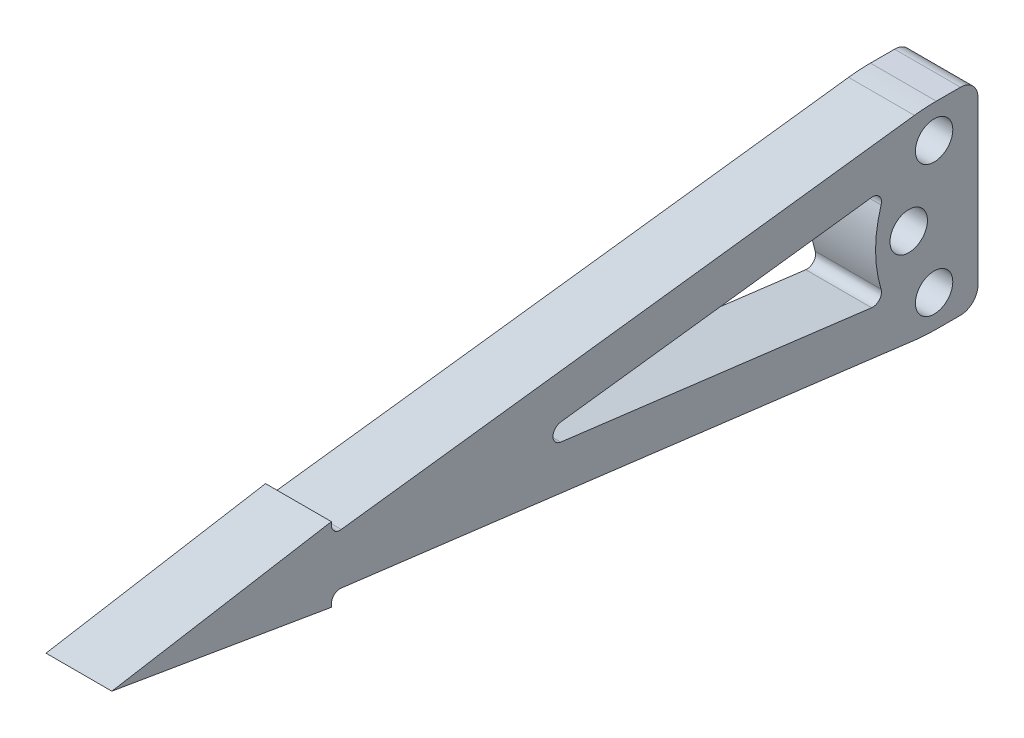
ISO-10303-21;
HEADER;
FILE_DESCRIPTION(('STEP AP214'),'2;1');
FILE_NAME('part.step','',(''),(''),'','','');
FILE_SCHEMA(('AUTOMOTIVE_DESIGN { 1 0 10303 214 1 1 1 1 }'));
ENDSEC;
DATA;
#1=APPLICATION_CONTEXT('core data for automotive mechanical design processes');
#2=APPLICATION_PROTOCOL_DEFINITION('international standard','automotive_design',2000,#1);
#3=PRODUCT_CONTEXT('',#1,'mechanical');
#4=PRODUCT('Part','Part','',(#3));
#5=PRODUCT_RELATED_PRODUCT_CATEGORY('part','',(#4));
#6=PRODUCT_DEFINITION_FORMATION('','',#4);
#7=PRODUCT_DEFINITION_CONTEXT('part definition',#1,'design');
#8=PRODUCT_DEFINITION('design','',#6,#7);
#9=PRODUCT_DEFINITION_SHAPE('','',#8);
#10=(LENGTH_UNIT() NAMED_UNIT(*) SI_UNIT(.MILLI.,.METRE.));
#11=(NAMED_UNIT(*) PLANE_ANGLE_UNIT() SI_UNIT($,.RADIAN.));
#12=(NAMED_UNIT(*) SI_UNIT($,.STERADIAN.) SOLID_ANGLE_UNIT());
#13=UNCERTAINTY_MEASURE_WITH_UNIT(LENGTH_MEASURE(1.E-05),#10,'distance_accuracy_value','');
#14=(GEOMETRIC_REPRESENTATION_CONTEXT(3) GLOBAL_UNCERTAINTY_ASSIGNED_CONTEXT((#13)) GLOBAL_UNIT_ASSIGNED_CONTEXT((#10,
#11,#12)) REPRESENTATION_CONTEXT('',''));
#15=CARTESIAN_POINT('',(0.,0.,0.));
#16=DIRECTION('',(0.,0.,1.));
#17=DIRECTION('',(1.,0.,0.));
#18=AXIS2_PLACEMENT_3D('',#15,#16,#17);
#19=CARTESIAN_POINT('',(-47.625,21.9075,120.65));
#20=DIRECTION('',(0.,0.992196421373541,-0.124684647866279));
#21=DIRECTION('',(0.,0.124684647866279,0.992196421373541));
#22=AXIS2_PLACEMENT_3D('',#19,#20,#21);
#23=PLANE('',#22);
#24=DIRECTION('',(0.,0.124684647866279,0.992196421373541));
#25=VECTOR('',#24,1.);
#26=CARTESIAN_POINT('',(-47.625,21.9075,120.65));
#27=LINE('',#26,#25);
#28=CARTESIAN_POINT('',(-47.625,11.310710897112,36.3244923624304));
#29=VERTEX_POINT('',#28);
#30=CARTESIAN_POINT('',(-47.625,21.7280060500633,119.22165049721));
#31=VERTEX_POINT('',#30);
#32=EDGE_CURVE('E192',#29,#31,#27,.T.);
#33=ORIENTED_EDGE('',*,*,#32,.F.);
#34=DIRECTION('',(1.,0.,0.));
#35=VECTOR('',#34,1.);
#36=CARTESIAN_POINT('',(-47.625,11.310710897112,36.3244923624304));
#37=LINE('',#36,#35);
#38=CARTESIAN_POINT('',(-38.1,11.310710897112,36.3244923624304));
#39=VERTEX_POINT('',#38);
#40=EDGE_CURVE('E331',#29,#39,#37,.T.);
#41=ORIENTED_EDGE('',*,*,#40,.T.);
#42=DIRECTION('',(0.,0.124684647866279,0.992196421373541));
#43=VECTOR('',#42,1.);
#44=CARTESIAN_POINT('',(-38.1,21.9075,120.65));
#45=LINE('',#44,#43);
#46=CARTESIAN_POINT('',(-38.1,21.7280060500633,119.22165049721));
#47=VERTEX_POINT('',#46);
#48=EDGE_CURVE('E225',#39,#47,#45,.T.);
#49=ORIENTED_EDGE('',*,*,#48,.T.);
#50=DIRECTION('',(1.,0.,0.));
#51=VECTOR('',#50,1.);
#52=CARTESIAN_POINT('',(-47.625,21.7280060500633,119.22165049721));
#53=LINE('',#52,#51);
#54=EDGE_CURVE('E315',#47,#31,#53,.F.);
#55=ORIENTED_EDGE('',*,*,#54,.T.);
#56=EDGE_LOOP('',(#33,#41,#49,#55));
#57=FACE_BOUND('',#56,.T.);
#58=ADVANCED_FACE('F39',(#57),#23,.F.);
#59=CARTESIAN_POINT('',(-47.625,20.0332704824739,120.65));
#60=DIRECTION('',(0.,0.,1.));
#61=DIRECTION('',(1.,0.,0.));
#62=AXIS2_PLACEMENT_3D('',#59,#60,#61);
#63=PLANE('',#62);
#64=DIRECTION('',(0.,-1.,0.));
#65=VECTOR('',#64,1.);
#66=CARTESIAN_POINT('',(-47.625,20.0332704824739,120.65));
#67=LINE('',#66,#65);
#68=CARTESIAN_POINT('',(-47.625,20.4679165949189,120.65));
#69=VERTEX_POINT('',#68);
#70=CARTESIAN_POINT('',(-47.625,20.0332704824739,120.65));
#71=VERTEX_POINT('',#70);
#72=EDGE_CURVE('E180',#69,#71,#67,.T.);
#73=ORIENTED_EDGE('',*,*,#72,.F.);
#74=DIRECTION('',(1.,0.,0.));
#75=VECTOR('',#74,1.);
#76=CARTESIAN_POINT('',(-38.1,20.4679165949189,120.65));
#77=LINE('',#76,#75);
#78=CARTESIAN_POINT('',(-38.1,20.4679165949189,120.65));
#79=VERTEX_POINT('',#78);
#80=EDGE_CURVE('E313',#69,#79,#77,.T.);
#81=ORIENTED_EDGE('',*,*,#80,.T.);
#82=DIRECTION('',(0.,-1.,0.));
#83=VECTOR('',#82,1.);
#84=CARTESIAN_POINT('',(-38.1,20.0332704824739,120.65));
#85=LINE('',#84,#83);
#86=CARTESIAN_POINT('',(-38.1,20.0332704824739,120.65));
#87=VERTEX_POINT('',#86);
#88=EDGE_CURVE('E198',#79,#87,#85,.T.);
#89=ORIENTED_EDGE('',*,*,#88,.T.);
#90=DIRECTION('',(1.,0.,0.));
#91=VECTOR('',#90,1.);
#92=CARTESIAN_POINT('',(-47.625,20.0332704824739,120.65));
#93=LINE('',#92,#91);
#94=EDGE_CURVE('E195',#71,#87,#93,.T.);
#95=ORIENTED_EDGE('',*,*,#94,.F.);
#96=EDGE_LOOP('',(#73,#81,#89,#95));
#97=FACE_BOUND('',#96,.T.);
#98=ADVANCED_FACE('F196',(#97),#63,.F.);
#99=CARTESIAN_POINT('',(-47.625,25.4,152.4));
#100=DIRECTION('',(0.,0.986013297183269,-0.166666666666666));
#101=DIRECTION('',(0.,0.166666666666666,0.986013297183269));
#102=AXIS2_PLACEMENT_3D('',#99,#100,#101);
#103=PLANE('',#102);
#104=DIRECTION('',(0.,0.166666666666666,0.986013297183269));
#105=VECTOR('',#104,1.);
#106=CARTESIAN_POINT('',(-38.1,25.4,152.4));
#107=LINE('',#106,#105);
#108=CARTESIAN_POINT('',(-38.1,25.4,152.4));
#109=VERTEX_POINT('',#108);
#110=EDGE_CURVE('E229',#87,#109,#107,.T.);
#111=ORIENTED_EDGE('',*,*,#110,.T.);
#112=DIRECTION('',(1.,0.,0.));
#113=VECTOR('',#112,1.);
#114=CARTESIAN_POINT('',(-47.625,25.4,152.4));
#115=LINE('',#114,#113);
#116=CARTESIAN_POINT('',(-47.625,25.4,152.4));
#117=VERTEX_POINT('',#116);
#118=EDGE_CURVE('E202',#117,#109,#115,.T.);
#119=ORIENTED_EDGE('',*,*,#118,.F.);
#120=DIRECTION('',(0.,0.166666666666666,0.986013297183269));
#121=VECTOR('',#120,1.);
#122=CARTESIAN_POINT('',(-47.625,25.4,152.4));
#123=LINE('',#122,#121);
#124=EDGE_CURVE('E185',#71,#117,#123,.T.);
#125=ORIENTED_EDGE('',*,*,#124,.F.);
#126=ORIENTED_EDGE('',*,*,#94,.T.);
#127=EDGE_LOOP('',(#111,#119,#125,#126));
#128=FACE_BOUND('',#127,.T.);
#129=ADVANCED_FACE('F204',(#128),#103,.F.);
#130=CARTESIAN_POINT('',(-47.625,30.7667295175261,120.65));
#131=DIRECTION('',(0.,-0.986013297183269,-0.166666666666667));
#132=DIRECTION('',(0.,0.166666666666667,-0.986013297183269));
#133=AXIS2_PLACEMENT_3D('',#130,#131,#132);
#134=PLANE('',#133);
#135=DIRECTION('',(0.,0.166666666666667,-0.986013297183269));
#136=VECTOR('',#135,1.);
#137=CARTESIAN_POINT('',(-38.1,30.7667295175261,120.65));
#138=LINE('',#137,#136);
#139=CARTESIAN_POINT('',(-38.1,30.7667295175261,120.65));
#140=VERTEX_POINT('',#139);
#141=EDGE_CURVE('E231',#109,#140,#138,.T.);
#142=ORIENTED_EDGE('',*,*,#141,.T.);
#143=DIRECTION('',(1.,0.,0.));
#144=VECTOR('',#143,1.);
#145=CARTESIAN_POINT('',(-47.625,30.7667295175261,120.65));
#146=LINE('',#145,#144);
#147=CARTESIAN_POINT('',(-47.625,30.7667295175261,120.65));
#148=VERTEX_POINT('',#147);
#149=EDGE_CURVE('E224',#148,#140,#146,.T.);
#150=ORIENTED_EDGE('',*,*,#149,.F.);
#151=DIRECTION('',(0.,0.166666666666667,-0.986013297183269));
#152=VECTOR('',#151,1.);
#153=CARTESIAN_POINT('',(-47.625,30.7667295175261,120.65));
#154=LINE('',#153,#152);
#155=EDGE_CURVE('E207',#117,#148,#154,.T.);
#156=ORIENTED_EDGE('',*,*,#155,.F.);
#157=ORIENTED_EDGE('',*,*,#118,.T.);
#158=EDGE_LOOP('',(#142,#150,#156,#157));
#159=FACE_BOUND('',#158,.T.);
#160=ADVANCED_FACE('F505',(#159),#134,.F.);
#161=CARTESIAN_POINT('',(-47.625,28.8925,120.65));
#162=DIRECTION('',(0.,0.,1.));
#163=DIRECTION('',(1.,0.,0.));
#164=AXIS2_PLACEMENT_3D('',#161,#162,#163);
#165=PLANE('',#164);
#166=DIRECTION('',(0.,-1.,0.));
#167=VECTOR('',#166,1.);
#168=CARTESIAN_POINT('',(-38.1,28.8925,120.65));
#169=LINE('',#168,#167);
#170=CARTESIAN_POINT('',(-38.1,30.3320834050811,120.65));
#171=VERTEX_POINT('',#170);
#172=EDGE_CURVE('E233',#140,#171,#169,.T.);
#173=ORIENTED_EDGE('',*,*,#172,.T.);
#174=DIRECTION('',(1.,0.,0.));
#175=VECTOR('',#174,1.);
#176=CARTESIAN_POINT('',(-47.625,30.3320834050811,120.65));
#177=LINE('',#176,#175);
#178=CARTESIAN_POINT('',(-47.625,30.3320834050811,120.65));
#179=VERTEX_POINT('',#178);
#180=EDGE_CURVE('E321',#171,#179,#177,.F.);
#181=ORIENTED_EDGE('',*,*,#180,.T.);
#182=DIRECTION('',(0.,-1.,0.));
#183=VECTOR('',#182,1.);
#184=CARTESIAN_POINT('',(-47.625,28.8925,120.65));
#185=LINE('',#184,#183);
#186=EDGE_CURVE('E209',#148,#179,#185,.T.);
#187=ORIENTED_EDGE('',*,*,#186,.F.);
#188=ORIENTED_EDGE('',*,*,#149,.T.);
#189=EDGE_LOOP('',(#173,#181,#187,#188));
#190=FACE_BOUND('',#189,.T.);
#191=ADVANCED_FACE('F499',(#190),#165,.F.);
#192=CARTESIAN_POINT('',(-47.625,39.6875,34.7472));
#193=DIRECTION('',(0.,-0.992196421373541,-0.124684647866279));
#194=DIRECTION('',(0.,0.124684647866279,-0.992196421373541));
#195=AXIS2_PLACEMENT_3D('',#192,#193,#194);
#196=PLANE('',#195);
#197=DIRECTION('',(0.,0.124684647866279,-0.992196421373541));
#198=VECTOR('',#197,1.);
#199=CARTESIAN_POINT('',(-38.1,39.6875,34.7472));
#200=LINE('',#199,#198);
#201=CARTESIAN_POINT('',(-38.1,29.0719939499367,119.22165049721));
#202=VERTEX_POINT('',#201);
#203=CARTESIAN_POINT('',(-38.1,39.489289102888,36.3244923624304));
#204=VERTEX_POINT('',#203);
#205=EDGE_CURVE('E236',#202,#204,#200,.T.);
#206=ORIENTED_EDGE('',*,*,#205,.T.);
#207=DIRECTION('',(1.,0.,0.));
#208=VECTOR('',#207,1.);
#209=CARTESIAN_POINT('',(-47.625,39.489289102888,36.3244923624304));
#210=LINE('',#209,#208);
#211=CARTESIAN_POINT('',(-47.625,39.489289102888,36.3244923624304));
#212=VERTEX_POINT('',#211);
#213=EDGE_CURVE('E11',#204,#212,#210,.F.);
#214=ORIENTED_EDGE('',*,*,#213,.T.);
#215=DIRECTION('',(0.,0.124684647866279,-0.992196421373541));
#216=VECTOR('',#215,1.);
#217=CARTESIAN_POINT('',(-47.625,39.6875,34.7472));
#218=LINE('',#217,#216);
#219=CARTESIAN_POINT('',(-47.625,29.0719939499367,119.22165049721));
#220=VERTEX_POINT('',#219);
#221=EDGE_CURVE('E215',#220,#212,#218,.T.);
#222=ORIENTED_EDGE('',*,*,#221,.F.);
#223=DIRECTION('',(1.,0.,0.));
#224=VECTOR('',#223,1.);
#225=CARTESIAN_POINT('',(-38.1,29.0719939499367,119.22165049721));
#226=LINE('',#225,#224);
#227=EDGE_CURVE('E318',#220,#202,#226,.T.);
#228=ORIENTED_EDGE('',*,*,#227,.T.);
#229=EDGE_LOOP('',(#206,#214,#222,#228));
#230=FACE_BOUND('',#229,.T.);
#231=ADVANCED_FACE('F504',(#230),#196,.F.);
#232=CARTESIAN_POINT('',(-47.625,39.6875,27.1272));
#233=DIRECTION('',(0.,-1.,0.));
#234=DIRECTION('',(0.,0.,-1.));
#235=AXIS2_PLACEMENT_3D('',#232,#233,#234);
#236=PLANE('',#235);
#237=DIRECTION('',(0.,0.,-1.));
#238=VECTOR('',#237,1.);
#239=CARTESIAN_POINT('',(-47.625,39.6875,27.1272));
#240=LINE('',#239,#238);
#241=CARTESIAN_POINT('',(-47.625,39.6875,33.1575023066269));
#242=VERTEX_POINT('',#241);
#243=CARTESIAN_POINT('',(-47.625,39.6875,29.6672));
#244=VERTEX_POINT('',#243);
#245=EDGE_CURVE('E217',#242,#244,#240,.T.);
#246=ORIENTED_EDGE('',*,*,#245,.F.);
#247=DIRECTION('',(1.,0.,0.));
#248=VECTOR('',#247,1.);
#249=CARTESIAN_POINT('',(-47.625,39.6875,33.1575023066269));
#250=LINE('',#249,#248);
#251=CARTESIAN_POINT('',(-38.1,39.6875,33.1575023066269));
#252=VERTEX_POINT('',#251);
#253=EDGE_CURVE('E47',#242,#252,#250,.T.);
#254=ORIENTED_EDGE('',*,*,#253,.T.);
#255=DIRECTION('',(0.,0.,-1.));
#256=VECTOR('',#255,1.);
#257=CARTESIAN_POINT('',(-38.1,39.6875,27.1272));
#258=LINE('',#257,#256);
#259=CARTESIAN_POINT('',(-38.1,39.6875,29.6672));
#260=VERTEX_POINT('',#259);
#261=EDGE_CURVE('E238',#252,#260,#258,.T.);
#262=ORIENTED_EDGE('',*,*,#261,.T.);
#263=DIRECTION('',(1.,0.,0.));
#264=VECTOR('',#263,1.);
#265=CARTESIAN_POINT('',(-47.625,39.6875,29.6672));
#266=LINE('',#265,#264);
#267=EDGE_CURVE('E283',#260,#244,#266,.F.);
#268=ORIENTED_EDGE('',*,*,#267,.T.);
#269=EDGE_LOOP('',(#246,#254,#262,#268));
#270=FACE_BOUND('',#269,.T.);
#271=ADVANCED_FACE('F346',(#270),#236,.F.);
#272=CARTESIAN_POINT('',(-47.625,11.1125,27.1272));
#273=DIRECTION('',(0.,0.,1.));
#274=DIRECTION('',(1.,0.,0.));
#275=AXIS2_PLACEMENT_3D('',#272,#273,#274);
#276=PLANE('',#275);
#277=DIRECTION('',(0.,-1.,0.));
#278=VECTOR('',#277,1.);
#279=CARTESIAN_POINT('',(-38.1,11.1125,27.1272));
#280=LINE('',#279,#278);
#281=CARTESIAN_POINT('',(-38.1,37.1475,27.1272));
#282=VERTEX_POINT('',#281);
#283=CARTESIAN_POINT('',(-38.1,13.6525,27.1272));
#284=VERTEX_POINT('',#283);
#285=EDGE_CURVE('E240',#282,#284,#280,.T.);
#286=ORIENTED_EDGE('',*,*,#285,.T.);
#287=DIRECTION('',(1.,0.,0.));
#288=VECTOR('',#287,1.);
#289=CARTESIAN_POINT('',(-47.625,13.6525,27.1272));
#290=LINE('',#289,#288);
#291=CARTESIAN_POINT('',(-47.625,13.6525,27.1272));
#292=VERTEX_POINT('',#291);
#293=EDGE_CURVE('E277',#284,#292,#290,.F.);
#294=ORIENTED_EDGE('',*,*,#293,.T.);
#295=DIRECTION('',(0.,-1.,0.));
#296=VECTOR('',#295,1.);
#297=CARTESIAN_POINT('',(-47.625,11.1125,27.1272));
#298=LINE('',#297,#296);
#299=CARTESIAN_POINT('',(-47.625,37.1475,27.1272));
#300=VERTEX_POINT('',#299);
#301=EDGE_CURVE('E219',#300,#292,#298,.T.);
#302=ORIENTED_EDGE('',*,*,#301,.F.);
#303=DIRECTION('',(1.,0.,0.));
#304=VECTOR('',#303,1.);
#305=CARTESIAN_POINT('',(-47.625,37.1475,27.1272));
#306=LINE('',#305,#304);
#307=EDGE_CURVE('E274',#300,#282,#306,.T.);
#308=ORIENTED_EDGE('',*,*,#307,.T.);
#309=EDGE_LOOP('',(#286,#294,#302,#308));
#310=FACE_BOUND('',#309,.T.);
#311=ADVANCED_FACE('F361',(#310),#276,.F.);
#312=CARTESIAN_POINT('',(-47.625,11.1125,34.7472));
#313=DIRECTION('',(0.,1.,0.));
#314=DIRECTION('',(0.,0.,1.));
#315=AXIS2_PLACEMENT_3D('',#312,#313,#314);
#316=PLANE('',#315);
#317=DIRECTION('',(0.,0.,1.));
#318=VECTOR('',#317,1.);
#319=CARTESIAN_POINT('',(-38.1,11.1125,34.7472));
#320=LINE('',#319,#318);
#321=CARTESIAN_POINT('',(-38.1,11.1125,29.6672));
#322=VERTEX_POINT('',#321);
#323=CARTESIAN_POINT('',(-38.1,11.1125,33.1575023066269));
#324=VERTEX_POINT('',#323);
#325=EDGE_CURVE('E243',#322,#324,#320,.T.);
#326=ORIENTED_EDGE('',*,*,#325,.T.);
#327=DIRECTION('',(1.,0.,0.));
#328=VECTOR('',#327,1.);
#329=CARTESIAN_POINT('',(-47.625,11.1125,33.1575023066269));
#330=LINE('',#329,#328);
#331=CARTESIAN_POINT('',(-47.625,11.1125,33.1575023066269));
#332=VERTEX_POINT('',#331);
#333=EDGE_CURVE('E338',#324,#332,#330,.F.);
#334=ORIENTED_EDGE('',*,*,#333,.T.);
#335=DIRECTION('',(0.,0.,1.));
#336=VECTOR('',#335,1.);
#337=CARTESIAN_POINT('',(-47.625,11.1125,34.7472));
#338=LINE('',#337,#336);
#339=CARTESIAN_POINT('',(-47.625,11.1125,29.6672));
#340=VERTEX_POINT('',#339);
#341=EDGE_CURVE('E222',#340,#332,#338,.T.);
#342=ORIENTED_EDGE('',*,*,#341,.F.);
#343=DIRECTION('',(1.,0.,0.));
#344=VECTOR('',#343,1.);
#345=CARTESIAN_POINT('',(-47.625,11.1125,29.6672));
#346=LINE('',#345,#344);
#347=EDGE_CURVE('E257',#340,#322,#346,.T.);
#348=ORIENTED_EDGE('',*,*,#347,.T.);
#349=EDGE_LOOP('',(#326,#334,#342,#348));
#350=FACE_BOUND('',#349,.T.);
#351=ADVANCED_FACE('F369',(#350),#316,.F.);
#352=CARTESIAN_POINT('',(-47.625,0.,0.));
#353=DIRECTION('',(1.,0.,0.));
#354=DIRECTION('',(0.,0.,-1.));
#355=AXIS2_PLACEMENT_3D('',#352,#353,#354);
#356=PLANE('',#355);
#357=CARTESIAN_POINT('',(-47.625,34.925,33.4772));
#358=DIRECTION('',(-1.,0.,0.));
#359=DIRECTION('',(0.,0.,1.));
#360=AXIS2_PLACEMENT_3D('',#357,#358,#359);
#361=CIRCLE('',#360,2.7051);
#362=CARTESIAN_POINT('',(-47.625,34.925,36.1823));
#363=VERTEX_POINT('',#362);
#364=EDGE_CURVE('E262',#363,#363,#361,.T.);
#365=ORIENTED_EDGE('',*,*,#364,.F.);
#366=EDGE_LOOP('',(#365));
#367=FACE_BOUND('',#366,.T.);
#368=CARTESIAN_POINT('',(-47.625,25.4,37.1437958465632));
#369=DIRECTION('',(-1.,0.,0.));
#370=DIRECTION('',(0.,0.,1.));
#371=AXIS2_PLACEMENT_3D('',#368,#369,#370);
#372=CIRCLE('',#371,2.7051);
#373=CARTESIAN_POINT('',(-47.625,25.4,39.8488958465632));
#374=VERTEX_POINT('',#373);
#375=EDGE_CURVE('E391',#374,#374,#372,.T.);
#376=ORIENTED_EDGE('',*,*,#375,.F.);
#377=EDGE_LOOP('',(#376));
#378=FACE_BOUND('',#377,.T.);
#379=CARTESIAN_POINT('',(-47.625,15.875,33.4772));
#380=DIRECTION('',(-1.,0.,0.));
#381=DIRECTION('',(0.,0.,1.));
#382=AXIS2_PLACEMENT_3D('',#379,#380,#381);
#383=CIRCLE('',#382,2.7051);
#384=CARTESIAN_POINT('',(-47.625,15.875,36.1823));
#385=VERTEX_POINT('',#384);
#386=EDGE_CURVE('E382',#385,#385,#383,.T.);
#387=ORIENTED_EDGE('',*,*,#386,.F.);
#388=EDGE_LOOP('',(#387));
#389=FACE_BOUND('',#388,.T.);
#390=DIRECTION('',(0.,0.124684647866279,0.992196421373541));
#391=VECTOR('',#390,1.);
#392=CARTESIAN_POINT('',(-47.625,25.4,97.5135991060685));
#393=LINE('',#392,#391);
#394=CARTESIAN_POINT('',(-47.625,18.4886100444257,42.51519715371));
#395=VERTEX_POINT('',#394);
#396=CARTESIAN_POINT('',(-47.625,24.1399105448556,87.4862519594841));
#397=VERTEX_POINT('',#396);
#398=EDGE_CURVE('E383',#395,#397,#393,.T.);
#399=ORIENTED_EDGE('',*,*,#398,.F.);
#400=CARTESIAN_POINT('',(-47.625,19.7486994995701,42.3568476509198));
#401=DIRECTION('',(1.,0.,0.));
#402=DIRECTION('',(0.,0.,-1.));
#403=AXIS2_PLACEMENT_3D('',#400,#401,#402);
#404=CIRCLE('',#403,1.27);
#405=CARTESIAN_POINT('',(-47.625,20.1254528662654,41.1440175306294));
#406=VERTEX_POINT('',#405);
#407=EDGE_CURVE('E305',#395,#406,#404,.T.);
#408=ORIENTED_EDGE('',*,*,#407,.T.);
#409=CARTESIAN_POINT('',(-47.625,25.4,24.1643958465632));
#410=DIRECTION('',(1.,0.,0.));
#411=DIRECTION('',(0.,0.,1.));
#412=AXIS2_PLACEMENT_3D('',#409,#410,#411);
#413=CIRCLE('',#412,17.78);
#414=CARTESIAN_POINT('',(-47.625,30.6745471337346,41.1440175306294));
#415=VERTEX_POINT('',#414);
#416=EDGE_CURVE('E379',#415,#406,#413,.T.);
#417=ORIENTED_EDGE('',*,*,#416,.F.);
#418=CARTESIAN_POINT('',(-47.625,31.0513005004299,42.3568476509198));
#419=DIRECTION('',(1.,0.,0.));
#420=DIRECTION('',(0.,0.,-1.));
#421=AXIS2_PLACEMENT_3D('',#418,#419,#420);
#422=CIRCLE('',#421,1.27);
#423=CARTESIAN_POINT('',(-47.625,32.3113899555743,42.51519715371));
#424=VERTEX_POINT('',#423);
#425=EDGE_CURVE('E309',#415,#424,#422,.T.);
#426=ORIENTED_EDGE('',*,*,#425,.T.);
#427=DIRECTION('',(0.,0.124684647866279,-0.992196421373541));
#428=VECTOR('',#427,1.);
#429=CARTESIAN_POINT('',(-47.625,32.5730160254941,40.433269227901));
#430=LINE('',#429,#428);
#431=CARTESIAN_POINT('',(-47.625,26.6600894551444,87.4862519594842));
#432=VERTEX_POINT('',#431);
#433=EDGE_CURVE('E386',#432,#424,#430,.T.);
#434=ORIENTED_EDGE('',*,*,#433,.F.);
#435=CARTESIAN_POINT('',(-47.625,25.4,87.327902456694));
#436=DIRECTION('',(1.,0.,0.));
#437=DIRECTION('',(0.,0.,-1.));
#438=AXIS2_PLACEMENT_3D('',#435,#436,#437);
#439=CIRCLE('',#438,1.27);
#440=EDGE_CURVE('E301',#432,#397,#439,.T.);
#441=ORIENTED_EDGE('',*,*,#440,.T.);
#442=EDGE_LOOP('',(#399,#408,#417,#426,#434,#441));
#443=FACE_BOUND('',#442,.T.);
#444=ORIENTED_EDGE('',*,*,#341,.T.);
#445=CARTESIAN_POINT('',(-47.625,36.5125,33.1575023066269));
#446=DIRECTION('',(1.,0.,0.));
#447=DIRECTION('',(0.,0.,-1.));
#448=AXIS2_PLACEMENT_3D('',#445,#446,#447);
#449=CIRCLE('',#448,25.4);
#450=EDGE_CURVE('E341',#332,#29,#449,.F.);
#451=ORIENTED_EDGE('',*,*,#450,.T.);
#452=ORIENTED_EDGE('',*,*,#32,.T.);
#453=CARTESIAN_POINT('',(-47.625,20.4679165949189,119.38));
#454=DIRECTION('',(1.,0.,0.));
#455=DIRECTION('',(0.,0.,-1.));
#456=AXIS2_PLACEMENT_3D('',#453,#454,#455);
#457=CIRCLE('',#456,1.27);
#458=EDGE_CURVE('E188',#31,#69,#457,.T.);
#459=ORIENTED_EDGE('',*,*,#458,.T.);
#460=ORIENTED_EDGE('',*,*,#72,.T.);
#461=ORIENTED_EDGE('',*,*,#124,.T.);
#462=ORIENTED_EDGE('',*,*,#155,.T.);
#463=ORIENTED_EDGE('',*,*,#186,.T.);
#464=CARTESIAN_POINT('',(-47.625,30.3320834050811,119.38));
#465=DIRECTION('',(1.,0.,0.));
#466=DIRECTION('',(0.,0.,-1.));
#467=AXIS2_PLACEMENT_3D('',#464,#465,#466);
#468=CIRCLE('',#467,1.27);
#469=EDGE_CURVE('E329',#179,#220,#468,.T.);
#470=ORIENTED_EDGE('',*,*,#469,.T.);
#471=ORIENTED_EDGE('',*,*,#221,.T.);
#472=CARTESIAN_POINT('',(-47.625,14.2875,33.1575023066269));
#473=DIRECTION('',(1.,0.,0.));
#474=DIRECTION('',(0.,0.,-1.));
#475=AXIS2_PLACEMENT_3D('',#472,#473,#474);
#476=CIRCLE('',#475,25.4);
#477=EDGE_CURVE('E54',#212,#242,#476,.F.);
#478=ORIENTED_EDGE('',*,*,#477,.T.);
#479=ORIENTED_EDGE('',*,*,#245,.T.);
#480=CARTESIAN_POINT('',(-47.625,37.1475,29.6672));
#481=DIRECTION('',(1.,0.,0.));
#482=DIRECTION('',(0.,0.,-1.));
#483=AXIS2_PLACEMENT_3D('',#480,#481,#482);
#484=CIRCLE('',#483,2.54);
#485=EDGE_CURVE('E279',#244,#300,#484,.F.);
#486=ORIENTED_EDGE('',*,*,#485,.T.);
#487=ORIENTED_EDGE('',*,*,#301,.T.);
#488=CARTESIAN_POINT('',(-47.625,13.6525,29.6672));
#489=DIRECTION('',(1.,0.,0.));
#490=DIRECTION('',(0.,0.,-1.));
#491=AXIS2_PLACEMENT_3D('',#488,#489,#490);
#492=CIRCLE('',#491,2.54);
#493=EDGE_CURVE('E281',#292,#340,#492,.F.);
#494=ORIENTED_EDGE('',*,*,#493,.T.);
#495=EDGE_LOOP('',(#444,#451,#452,#459,#460,#461,#462,#463,#470,#471,#478,#479,#486,#487,#494));
#496=FACE_BOUND('',#495,.T.);
#497=ADVANCED_FACE('F183',(#367,#378,#389,#443,#496),#356,.F.);
#498=CARTESIAN_POINT('',(-38.1,0.,0.));
#499=DIRECTION('',(1.,0.,0.));
#500=DIRECTION('',(0.,0.,-1.));
#501=AXIS2_PLACEMENT_3D('',#498,#499,#500);
#502=PLANE('',#501);
#503=CARTESIAN_POINT('',(-38.1,34.925,33.4772));
#504=DIRECTION('',(1.,0.,0.));
#505=DIRECTION('',(0.,0.,-1.));
#506=AXIS2_PLACEMENT_3D('',#503,#504,#505);
#507=CIRCLE('',#506,2.7051);
#508=CARTESIAN_POINT('',(-38.1,34.925,30.7721));
#509=VERTEX_POINT('',#508);
#510=EDGE_CURVE('E227',#509,#509,#507,.T.);
#511=ORIENTED_EDGE('',*,*,#510,.F.);
#512=EDGE_LOOP('',(#511));
#513=FACE_BOUND('',#512,.T.);
#514=CARTESIAN_POINT('',(-38.1,25.4,37.1437958465632));
#515=DIRECTION('',(1.,0.,0.));
#516=DIRECTION('',(0.,0.,-1.));
#517=AXIS2_PLACEMENT_3D('',#514,#515,#516);
#518=CIRCLE('',#517,2.7051);
#519=CARTESIAN_POINT('',(-38.1,25.4,34.4386958465632));
#520=VERTEX_POINT('',#519);
#521=EDGE_CURVE('E261',#520,#520,#518,.T.);
#522=ORIENTED_EDGE('',*,*,#521,.F.);
#523=EDGE_LOOP('',(#522));
#524=FACE_BOUND('',#523,.T.);
#525=CARTESIAN_POINT('',(-38.1,15.875,33.4772));
#526=DIRECTION('',(1.,0.,0.));
#527=DIRECTION('',(0.,0.,-1.));
#528=AXIS2_PLACEMENT_3D('',#525,#526,#527);
#529=CIRCLE('',#528,2.7051);
#530=CARTESIAN_POINT('',(-38.1,15.875,30.7721));
#531=VERTEX_POINT('',#530);
#532=EDGE_CURVE('E258',#531,#531,#529,.T.);
#533=ORIENTED_EDGE('',*,*,#532,.F.);
#534=EDGE_LOOP('',(#533));
#535=FACE_BOUND('',#534,.T.);
#536=CARTESIAN_POINT('',(-38.1,25.4,24.1643958465632));
#537=DIRECTION('',(1.,0.,0.));
#538=DIRECTION('',(0.,0.,-1.));
#539=AXIS2_PLACEMENT_3D('',#536,#537,#538);
#540=CIRCLE('',#539,17.78);
#541=CARTESIAN_POINT('',(-38.1,20.1254528662654,41.1440175306294));
#542=VERTEX_POINT('',#541);
#543=CARTESIAN_POINT('',(-38.1,30.6745471337346,41.1440175306294));
#544=VERTEX_POINT('',#543);
#545=EDGE_CURVE('E254',#542,#544,#540,.F.);
#546=ORIENTED_EDGE('',*,*,#545,.F.);
#547=CARTESIAN_POINT('',(-38.1,19.7486994995701,42.3568476509198));
#548=DIRECTION('',(1.,0.,0.));
#549=DIRECTION('',(0.,0.,-1.));
#550=AXIS2_PLACEMENT_3D('',#547,#548,#549);
#551=CIRCLE('',#550,1.27);
#552=CARTESIAN_POINT('',(-38.1,18.4886100444257,42.51519715371));
#553=VERTEX_POINT('',#552);
#554=EDGE_CURVE('E307',#542,#553,#551,.F.);
#555=ORIENTED_EDGE('',*,*,#554,.T.);
#556=DIRECTION('',(0.,-0.124684647866279,-0.992196421373541));
#557=VECTOR('',#556,1.);
#558=CARTESIAN_POINT('',(-38.1,12.9415556043093,-1.62630429681593));
#559=LINE('',#558,#557);
#560=CARTESIAN_POINT('',(-38.1,24.1399105448556,87.4862519594841));
#561=VERTEX_POINT('',#560);
#562=EDGE_CURVE('E201',#561,#553,#559,.T.);
#563=ORIENTED_EDGE('',*,*,#562,.F.);
#564=CARTESIAN_POINT('',(-38.1,25.4,87.327902456694));
#565=DIRECTION('',(1.,0.,0.));
#566=DIRECTION('',(0.,0.,-1.));
#567=AXIS2_PLACEMENT_3D('',#564,#565,#566);
#568=CIRCLE('',#567,1.27);
#569=CARTESIAN_POINT('',(-38.1,26.6600894551444,87.4862519594841));
#570=VERTEX_POINT('',#569);
#571=EDGE_CURVE('E303',#561,#570,#568,.F.);
#572=ORIENTED_EDGE('',*,*,#571,.T.);
#573=DIRECTION('',(0.,-0.124684647866279,0.992196421373541));
#574=VECTOR('',#573,1.);
#575=CARTESIAN_POINT('',(-38.1,37.068694315883,4.65824810297169));
#576=LINE('',#575,#574);
#577=CARTESIAN_POINT('',(-38.1,32.3113899555743,42.51519715371));
#578=VERTEX_POINT('',#577);
#579=EDGE_CURVE('E251',#578,#570,#576,.T.);
#580=ORIENTED_EDGE('',*,*,#579,.F.);
#581=CARTESIAN_POINT('',(-38.1,31.0513005004299,42.3568476509198));
#582=DIRECTION('',(1.,0.,0.));
#583=DIRECTION('',(0.,0.,-1.));
#584=AXIS2_PLACEMENT_3D('',#581,#582,#583);
#585=CIRCLE('',#584,1.27);
#586=EDGE_CURVE('E311',#578,#544,#585,.F.);
#587=ORIENTED_EDGE('',*,*,#586,.T.);
#588=EDGE_LOOP('',(#546,#555,#563,#572,#580,#587));
#589=FACE_BOUND('',#588,.T.);
#590=ORIENTED_EDGE('',*,*,#48,.F.);
#591=CARTESIAN_POINT('',(-38.1,36.5125,33.1575023066269));
#592=DIRECTION('',(1.,0.,0.));
#593=DIRECTION('',(0.,0.,-1.));
#594=AXIS2_PLACEMENT_3D('',#591,#592,#593);
#595=CIRCLE('',#594,25.4);
#596=EDGE_CURVE('E336',#39,#324,#595,.T.);
#597=ORIENTED_EDGE('',*,*,#596,.T.);
#598=ORIENTED_EDGE('',*,*,#325,.F.);
#599=CARTESIAN_POINT('',(-38.1,13.6525,29.6672));
#600=DIRECTION('',(1.,0.,0.));
#601=DIRECTION('',(0.,0.,-1.));
#602=AXIS2_PLACEMENT_3D('',#599,#600,#601);
#603=CIRCLE('',#602,2.54);
#604=EDGE_CURVE('E272',#322,#284,#603,.T.);
#605=ORIENTED_EDGE('',*,*,#604,.T.);
#606=ORIENTED_EDGE('',*,*,#285,.F.);
#607=CARTESIAN_POINT('',(-38.1,37.1475,29.6672));
#608=DIRECTION('',(1.,0.,0.));
#609=DIRECTION('',(0.,0.,-1.));
#610=AXIS2_PLACEMENT_3D('',#607,#608,#609);
#611=CIRCLE('',#610,2.54);
#612=EDGE_CURVE('E269',#282,#260,#611,.T.);
#613=ORIENTED_EDGE('',*,*,#612,.T.);
#614=ORIENTED_EDGE('',*,*,#261,.F.);
#615=CARTESIAN_POINT('',(-38.1,14.2875,33.1575023066269));
#616=DIRECTION('',(1.,0.,0.));
#617=DIRECTION('',(0.,0.,-1.));
#618=AXIS2_PLACEMENT_3D('',#615,#616,#617);
#619=CIRCLE('',#618,25.4);
#620=EDGE_CURVE('E334',#252,#204,#619,.T.);
#621=ORIENTED_EDGE('',*,*,#620,.T.);
#622=ORIENTED_EDGE('',*,*,#205,.F.);
#623=CARTESIAN_POINT('',(-38.1,30.3320834050811,119.38));
#624=DIRECTION('',(1.,0.,0.));
#625=DIRECTION('',(0.,0.,-1.));
#626=AXIS2_PLACEMENT_3D('',#623,#624,#625);
#627=CIRCLE('',#626,1.27);
#628=EDGE_CURVE('E327',#202,#171,#627,.F.);
#629=ORIENTED_EDGE('',*,*,#628,.T.);
#630=ORIENTED_EDGE('',*,*,#172,.F.);
#631=ORIENTED_EDGE('',*,*,#141,.F.);
#632=ORIENTED_EDGE('',*,*,#110,.F.);
#633=ORIENTED_EDGE('',*,*,#88,.F.);
#634=CARTESIAN_POINT('',(-38.1,20.4679165949189,119.38));
#635=DIRECTION('',(1.,0.,0.));
#636=DIRECTION('',(0.,0.,-1.));
#637=AXIS2_PLACEMENT_3D('',#634,#635,#636);
#638=CIRCLE('',#637,1.27);
#639=EDGE_CURVE('E323',#79,#47,#638,.F.);
#640=ORIENTED_EDGE('',*,*,#639,.T.);
#641=EDGE_LOOP('',(#590,#597,#598,#605,#606,#613,#614,#621,#622,#629,#630,#631,#632,#633,#640));
#642=FACE_BOUND('',#641,.T.);
#643=ADVANCED_FACE('F350',(#513,#524,#535,#589,#642),#502,.T.);
#644=CARTESIAN_POINT('',(119.882956200926,25.4,24.1643958465632));
#645=DIRECTION('',(-1.,0.,0.));
#646=DIRECTION('',(0.,0.,1.));
#647=AXIS2_PLACEMENT_3D('',#644,#645,#646);
#648=CYLINDRICAL_SURFACE('',#647,17.78);
#649=ORIENTED_EDGE('',*,*,#416,.T.);
#650=DIRECTION('',(-1.,0.,0.));
#651=VECTOR('',#650,1.);
#652=CARTESIAN_POINT('',(119.882956200926,20.1254528662654,41.1440175306294));
#653=LINE('',#652,#651);
#654=EDGE_CURVE('E299',#406,#542,#653,.F.);
#655=ORIENTED_EDGE('',*,*,#654,.T.);
#656=ORIENTED_EDGE('',*,*,#545,.T.);
#657=DIRECTION('',(-1.,0.,0.));
#658=VECTOR('',#657,1.);
#659=CARTESIAN_POINT('',(119.882956200926,30.6745471337346,41.1440175306294));
#660=LINE('',#659,#658);
#661=EDGE_CURVE('E296',#544,#415,#660,.T.);
#662=ORIENTED_EDGE('',*,*,#661,.T.);
#663=EDGE_LOOP('',(#649,#655,#656,#662));
#664=FACE_BOUND('',#663,.T.);
#665=ADVANCED_FACE('F430',(#664),#648,.T.);
#666=CARTESIAN_POINT('',(119.882956200926,32.5730160254941,40.433269227901));
#667=DIRECTION('',(0.,0.992196421373541,0.124684647866279));
#668=DIRECTION('',(0.,-0.124684647866279,0.992196421373541));
#669=AXIS2_PLACEMENT_3D('',#666,#667,#668);
#670=PLANE('',#669);
#671=ORIENTED_EDGE('',*,*,#579,.T.);
#672=DIRECTION('',(-1.,0.,0.));
#673=VECTOR('',#672,1.);
#674=CARTESIAN_POINT('',(-47.6249999999999,26.6600894551444,87.4862519594841));
#675=LINE('',#674,#673);
#676=EDGE_CURVE('E288',#570,#432,#675,.T.);
#677=ORIENTED_EDGE('',*,*,#676,.T.);
#678=ORIENTED_EDGE('',*,*,#433,.T.);
#679=DIRECTION('',(1.,0.,0.));
#680=VECTOR('',#679,1.);
#681=CARTESIAN_POINT('',(-38.1,32.3113899555743,42.51519715371));
#682=LINE('',#681,#680);
#683=EDGE_CURVE('E286',#424,#578,#682,.T.);
#684=ORIENTED_EDGE('',*,*,#683,.T.);
#685=EDGE_LOOP('',(#671,#677,#678,#684));
#686=FACE_BOUND('',#685,.T.);
#687=ADVANCED_FACE('F423',(#686),#670,.F.);
#688=CARTESIAN_POINT('',(119.882956200926,25.4,97.5135991060685));
#689=DIRECTION('',(0.,-0.992196421373541,0.124684647866279));
#690=DIRECTION('',(0.,-0.124684647866279,-0.992196421373541));
#691=AXIS2_PLACEMENT_3D('',#688,#689,#690);
#692=PLANE('',#691);
#693=ORIENTED_EDGE('',*,*,#398,.T.);
#694=DIRECTION('',(-1.,0.,0.));
#695=VECTOR('',#694,1.);
#696=CARTESIAN_POINT('',(-38.0999999999999,24.1399105448556,87.4862519594841));
#697=LINE('',#696,#695);
#698=EDGE_CURVE('E294',#397,#561,#697,.F.);
#699=ORIENTED_EDGE('',*,*,#698,.T.);
#700=ORIENTED_EDGE('',*,*,#562,.T.);
#701=DIRECTION('',(1.,0.,0.));
#702=VECTOR('',#701,1.);
#703=CARTESIAN_POINT('',(-47.625,18.4886100444257,42.51519715371));
#704=LINE('',#703,#702);
#705=EDGE_CURVE('E291',#553,#395,#704,.F.);
#706=ORIENTED_EDGE('',*,*,#705,.T.);
#707=EDGE_LOOP('',(#693,#699,#700,#706));
#708=FACE_BOUND('',#707,.T.);
#709=ADVANCED_FACE('F411',(#708),#692,.F.);
#710=CARTESIAN_POINT('',(119.882956200926,15.875,33.4772));
#711=DIRECTION('',(-1.,0.,0.));
#712=DIRECTION('',(0.,0.,1.));
#713=AXIS2_PLACEMENT_3D('',#710,#711,#712);
#714=CYLINDRICAL_SURFACE('',#713,2.7051);
#715=ORIENTED_EDGE('',*,*,#532,.T.);
#716=EDGE_LOOP('',(#715));
#717=FACE_BOUND('',#716,.T.);
#718=ORIENTED_EDGE('',*,*,#386,.T.);
#719=EDGE_LOOP('',(#718));
#720=FACE_BOUND('',#719,.T.);
#721=ADVANCED_FACE('F630',(#717,#720),#714,.F.);
#722=CARTESIAN_POINT('',(119.882956200926,25.4,37.1437958465632));
#723=DIRECTION('',(-1.,0.,0.));
#724=DIRECTION('',(0.,0.,1.));
#725=AXIS2_PLACEMENT_3D('',#722,#723,#724);
#726=CYLINDRICAL_SURFACE('',#725,2.7051);
#727=ORIENTED_EDGE('',*,*,#521,.T.);
#728=EDGE_LOOP('',(#727));
#729=FACE_BOUND('',#728,.T.);
#730=ORIENTED_EDGE('',*,*,#375,.T.);
#731=EDGE_LOOP('',(#730));
#732=FACE_BOUND('',#731,.T.);
#733=ADVANCED_FACE('F621',(#729,#732),#726,.F.);
#734=CARTESIAN_POINT('',(119.882956200926,34.925,33.4772));
#735=DIRECTION('',(-1.,0.,0.));
#736=DIRECTION('',(0.,0.,1.));
#737=AXIS2_PLACEMENT_3D('',#734,#735,#736);
#738=CYLINDRICAL_SURFACE('',#737,2.7051);
#739=ORIENTED_EDGE('',*,*,#510,.T.);
#740=EDGE_LOOP('',(#739));
#741=FACE_BOUND('',#740,.T.);
#742=ORIENTED_EDGE('',*,*,#364,.T.);
#743=EDGE_LOOP('',(#742));
#744=FACE_BOUND('',#743,.T.);
#745=ADVANCED_FACE('F397',(#741,#744),#738,.F.);
#746=CARTESIAN_POINT('',(-47.625,13.6525,29.6672));
#747=DIRECTION('',(1.,0.,0.));
#748=DIRECTION('',(0.,0.,-1.));
#749=AXIS2_PLACEMENT_3D('',#746,#747,#748);
#750=CYLINDRICAL_SURFACE('',#749,2.54);
#751=ORIENTED_EDGE('',*,*,#493,.F.);
#752=ORIENTED_EDGE('',*,*,#293,.F.);
#753=ORIENTED_EDGE('',*,*,#604,.F.);
#754=ORIENTED_EDGE('',*,*,#347,.F.);
#755=EDGE_LOOP('',(#751,#752,#753,#754));
#756=FACE_BOUND('',#755,.T.);
#757=ADVANCED_FACE('F364',(#756),#750,.T.);
#758=CARTESIAN_POINT('',(-47.625,37.1475,29.6672));
#759=DIRECTION('',(1.,0.,0.));
#760=DIRECTION('',(0.,0.,-1.));
#761=AXIS2_PLACEMENT_3D('',#758,#759,#760);
#762=CYLINDRICAL_SURFACE('',#761,2.54);
#763=ORIENTED_EDGE('',*,*,#485,.F.);
#764=ORIENTED_EDGE('',*,*,#267,.F.);
#765=ORIENTED_EDGE('',*,*,#612,.F.);
#766=ORIENTED_EDGE('',*,*,#307,.F.);
#767=EDGE_LOOP('',(#763,#764,#765,#766));
#768=FACE_BOUND('',#767,.T.);
#769=ADVANCED_FACE('F357',(#768),#762,.T.);
#770=CARTESIAN_POINT('',(119.882956200926,25.4,87.327902456694));
#771=DIRECTION('',(1.,0.,0.));
#772=DIRECTION('',(0.,0.,-1.));
#773=AXIS2_PLACEMENT_3D('',#770,#771,#772);
#774=CYLINDRICAL_SURFACE('',#773,1.27);
#775=ORIENTED_EDGE('',*,*,#571,.F.);
#776=ORIENTED_EDGE('',*,*,#698,.F.);
#777=ORIENTED_EDGE('',*,*,#440,.F.);
#778=ORIENTED_EDGE('',*,*,#676,.F.);
#779=EDGE_LOOP('',(#775,#776,#777,#778));
#780=FACE_BOUND('',#779,.T.);
#781=ADVANCED_FACE('F416',(#780),#774,.F.);
#782=CARTESIAN_POINT('',(119.882956200926,19.7486994995701,42.3568476509198));
#783=DIRECTION('',(-1.,0.,0.));
#784=DIRECTION('',(0.,0.,1.));
#785=AXIS2_PLACEMENT_3D('',#782,#783,#784);
#786=CYLINDRICAL_SURFACE('',#785,1.27);
#787=ORIENTED_EDGE('',*,*,#554,.F.);
#788=ORIENTED_EDGE('',*,*,#654,.F.);
#789=ORIENTED_EDGE('',*,*,#407,.F.);
#790=ORIENTED_EDGE('',*,*,#705,.F.);
#791=EDGE_LOOP('',(#787,#788,#789,#790));
#792=FACE_BOUND('',#791,.T.);
#793=ADVANCED_FACE('F433',(#792),#786,.F.);
#794=CARTESIAN_POINT('',(119.882956200926,31.0513005004299,42.3568476509198));
#795=DIRECTION('',(-1.,0.,0.));
#796=DIRECTION('',(0.,0.,1.));
#797=AXIS2_PLACEMENT_3D('',#794,#795,#796);
#798=CYLINDRICAL_SURFACE('',#797,1.27);
#799=ORIENTED_EDGE('',*,*,#586,.F.);
#800=ORIENTED_EDGE('',*,*,#683,.F.);
#801=ORIENTED_EDGE('',*,*,#425,.F.);
#802=ORIENTED_EDGE('',*,*,#661,.F.);
#803=EDGE_LOOP('',(#799,#800,#801,#802));
#804=FACE_BOUND('',#803,.T.);
#805=ADVANCED_FACE('F426',(#804),#798,.F.);
#806=CARTESIAN_POINT('',(-47.625,20.4679165949189,119.38));
#807=DIRECTION('',(-1.,0.,0.));
#808=DIRECTION('',(0.,0.,1.));
#809=AXIS2_PLACEMENT_3D('',#806,#807,#808);
#810=CYLINDRICAL_SURFACE('',#809,1.27);
#811=ORIENTED_EDGE('',*,*,#458,.F.);
#812=ORIENTED_EDGE('',*,*,#54,.F.);
#813=ORIENTED_EDGE('',*,*,#639,.F.);
#814=ORIENTED_EDGE('',*,*,#80,.F.);
#815=EDGE_LOOP('',(#811,#812,#813,#814));
#816=FACE_BOUND('',#815,.T.);
#817=ADVANCED_FACE('F440',(#816),#810,.F.);
#818=CARTESIAN_POINT('',(-47.625,30.3320834050811,119.38));
#819=DIRECTION('',(-1.,0.,0.));
#820=DIRECTION('',(0.,0.,1.));
#821=AXIS2_PLACEMENT_3D('',#818,#819,#820);
#822=CYLINDRICAL_SURFACE('',#821,1.27);
#823=ORIENTED_EDGE('',*,*,#469,.F.);
#824=ORIENTED_EDGE('',*,*,#180,.F.);
#825=ORIENTED_EDGE('',*,*,#628,.F.);
#826=ORIENTED_EDGE('',*,*,#227,.F.);
#827=EDGE_LOOP('',(#823,#824,#825,#826));
#828=FACE_BOUND('',#827,.T.);
#829=ADVANCED_FACE('F518',(#828),#822,.F.);
#830=CARTESIAN_POINT('',(-47.625,36.5125,33.1575023066269));
#831=DIRECTION('',(1.,0.,0.));
#832=DIRECTION('',(0.,0.,-1.));
#833=AXIS2_PLACEMENT_3D('',#830,#831,#832);
#834=CYLINDRICAL_SURFACE('',#833,25.4);
#835=ORIENTED_EDGE('',*,*,#450,.F.);
#836=ORIENTED_EDGE('',*,*,#333,.F.);
#837=ORIENTED_EDGE('',*,*,#596,.F.);
#838=ORIENTED_EDGE('',*,*,#40,.F.);
#839=EDGE_LOOP('',(#835,#836,#837,#838));
#840=FACE_BOUND('',#839,.T.);
#841=ADVANCED_FACE('F373',(#840),#834,.T.);
#842=CARTESIAN_POINT('',(-47.625,14.2875,33.1575023066269));
#843=DIRECTION('',(1.,0.,0.));
#844=DIRECTION('',(0.,0.,-1.));
#845=AXIS2_PLACEMENT_3D('',#842,#843,#844);
#846=CYLINDRICAL_SURFACE('',#845,25.4);
#847=ORIENTED_EDGE('',*,*,#477,.F.);
#848=ORIENTED_EDGE('',*,*,#213,.F.);
#849=ORIENTED_EDGE('',*,*,#620,.F.);
#850=ORIENTED_EDGE('',*,*,#253,.F.);
#851=EDGE_LOOP('',(#847,#848,#849,#850));
#852=FACE_BOUND('',#851,.T.);
#853=ADVANCED_FACE('F41',(#852),#846,.T.);
#854=CLOSED_SHELL('',(#58,#98,#129,#160,#191,#231,#271,#311,#351,#497,#643,#665,#687,#709,#721,
#733,#745,#757,#769,#781,#793,#805,#817,#829,#841,#853));
#855=MANIFOLD_SOLID_BREP('B2',#854);
#856=ADVANCED_BREP_SHAPE_REPRESENTATION('',(#18,#855),#14);
#857=SHAPE_DEFINITION_REPRESENTATION(#9,#856);
ENDSEC;
END-ISO-10303-21;
